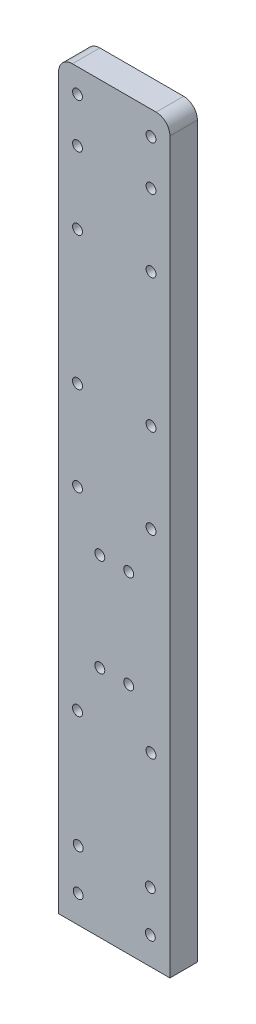
ISO-10303-21;
HEADER;
FILE_DESCRIPTION(('STEP AP214'),'2;1');
FILE_NAME('part.step','',(''),(''),'','','');
FILE_SCHEMA(('AUTOMOTIVE_DESIGN { 1 0 10303 214 1 1 1 1 }'));
ENDSEC;
DATA;
#1=APPLICATION_CONTEXT('core data for automotive mechanical design processes');
#2=APPLICATION_PROTOCOL_DEFINITION('international standard','automotive_design',2000,#1);
#3=PRODUCT_CONTEXT('',#1,'mechanical');
#4=PRODUCT('Part','Part','',(#3));
#5=PRODUCT_RELATED_PRODUCT_CATEGORY('part','',(#4));
#6=PRODUCT_DEFINITION_FORMATION('','',#4);
#7=PRODUCT_DEFINITION_CONTEXT('part definition',#1,'design');
#8=PRODUCT_DEFINITION('design','',#6,#7);
#9=PRODUCT_DEFINITION_SHAPE('','',#8);
#10=(LENGTH_UNIT() NAMED_UNIT(*) SI_UNIT(.MILLI.,.METRE.));
#11=(NAMED_UNIT(*) PLANE_ANGLE_UNIT() SI_UNIT($,.RADIAN.));
#12=(NAMED_UNIT(*) SI_UNIT($,.STERADIAN.) SOLID_ANGLE_UNIT());
#13=UNCERTAINTY_MEASURE_WITH_UNIT(LENGTH_MEASURE(1.E-05),#10,'distance_accuracy_value','');
#14=(GEOMETRIC_REPRESENTATION_CONTEXT(3) GLOBAL_UNCERTAINTY_ASSIGNED_CONTEXT((#13)) GLOBAL_UNIT_ASSIGNED_CONTEXT((#10,
#11,#12)) REPRESENTATION_CONTEXT('',''));
#15=CARTESIAN_POINT('',(0.,0.,0.));
#16=DIRECTION('',(0.,0.,1.));
#17=DIRECTION('',(1.,0.,0.));
#18=AXIS2_PLACEMENT_3D('',#15,#16,#17);
#19=CARTESIAN_POINT('',(0.,0.,4.));
#20=DIRECTION('',(0.,0.,1.));
#21=DIRECTION('',(1.,0.,0.));
#22=AXIS2_PLACEMENT_3D('',#19,#20,#21);
#23=PLANE('',#22);
#24=CARTESIAN_POINT('',(13.35,10.,4.));
#25=DIRECTION('',(0.,0.,1.));
#26=DIRECTION('',(-1.,0.,0.));
#27=AXIS2_PLACEMENT_3D('',#24,#25,#26);
#28=CIRCLE('',#27,0.72);
#29=CARTESIAN_POINT('',(12.63,10.,4.));
#30=VERTEX_POINT('',#29);
#31=EDGE_CURVE('E251',#30,#30,#28,.T.);
#32=ORIENTED_EDGE('',*,*,#31,.F.);
#33=EDGE_LOOP('',(#32));
#34=FACE_BOUND('',#33,.T.);
#35=CARTESIAN_POINT('',(2.85,10.,4.));
#36=DIRECTION('',(0.,0.,1.));
#37=DIRECTION('',(1.,0.,0.));
#38=AXIS2_PLACEMENT_3D('',#35,#36,#37);
#39=CIRCLE('',#38,0.72);
#40=CARTESIAN_POINT('',(3.57,10.,4.));
#41=VERTEX_POINT('',#40);
#42=EDGE_CURVE('E239',#41,#41,#39,.T.);
#43=ORIENTED_EDGE('',*,*,#42,.F.);
#44=EDGE_LOOP('',(#43));
#45=FACE_BOUND('',#44,.T.);
#46=CARTESIAN_POINT('',(2.74999999999998,68.21,4.));
#47=DIRECTION('',(0.,0.,1.));
#48=DIRECTION('',(1.,0.,0.));
#49=AXIS2_PLACEMENT_3D('',#46,#47,#48);
#50=CIRCLE('',#49,0.719999999999994);
#51=CARTESIAN_POINT('',(3.46999999999998,68.21,4.));
#52=VERTEX_POINT('',#51);
#53=EDGE_CURVE('E227',#52,#52,#50,.T.);
#54=ORIENTED_EDGE('',*,*,#53,.F.);
#55=EDGE_LOOP('',(#54));
#56=FACE_BOUND('',#55,.T.);
#57=CARTESIAN_POINT('',(2.74999999999999,55.21,4.));
#58=DIRECTION('',(0.,0.,1.));
#59=DIRECTION('',(1.,0.,0.));
#60=AXIS2_PLACEMENT_3D('',#57,#58,#59);
#61=CIRCLE('',#60,0.720000000000003);
#62=CARTESIAN_POINT('',(3.47,55.21,4.));
#63=VERTEX_POINT('',#62);
#64=EDGE_CURVE('E215',#63,#63,#61,.T.);
#65=ORIENTED_EDGE('',*,*,#64,.F.);
#66=EDGE_LOOP('',(#65));
#67=FACE_BOUND('',#66,.T.);
#68=CARTESIAN_POINT('',(13.45,104.66,4.));
#69=DIRECTION('',(0.,0.,1.));
#70=DIRECTION('',(-1.,0.,0.));
#71=AXIS2_PLACEMENT_3D('',#68,#69,#70);
#72=CIRCLE('',#71,0.71999999999999);
#73=CARTESIAN_POINT('',(12.73,104.66,4.));
#74=VERTEX_POINT('',#73);
#75=EDGE_CURVE('E203',#74,#74,#72,.T.);
#76=ORIENTED_EDGE('',*,*,#75,.F.);
#77=EDGE_LOOP('',(#76));
#78=FACE_BOUND('',#77,.T.);
#79=CARTESIAN_POINT('',(2.74999999999998,87.66,4.));
#80=DIRECTION('',(0.,0.,1.));
#81=DIRECTION('',(-1.,0.,0.));
#82=AXIS2_PLACEMENT_3D('',#79,#80,#81);
#83=CIRCLE('',#82,0.719999999999994);
#84=CARTESIAN_POINT('',(2.02999999999999,87.66,4.));
#85=VERTEX_POINT('',#84);
#86=EDGE_CURVE('E191',#85,#85,#83,.T.);
#87=ORIENTED_EDGE('',*,*,#86,.F.);
#88=EDGE_LOOP('',(#87));
#89=FACE_BOUND('',#88,.T.);
#90=CARTESIAN_POINT('',(2.75,27.,4.));
#91=DIRECTION('',(0.,0.,1.));
#92=DIRECTION('',(1.,0.,0.));
#93=AXIS2_PLACEMENT_3D('',#90,#91,#92);
#94=CIRCLE('',#93,0.72);
#95=CARTESIAN_POINT('',(3.47,27.,4.));
#96=VERTEX_POINT('',#95);
#97=EDGE_CURVE('E179',#96,#96,#94,.T.);
#98=ORIENTED_EDGE('',*,*,#97,.F.);
#99=EDGE_LOOP('',(#98));
#100=FACE_BOUND('',#99,.T.);
#101=CARTESIAN_POINT('',(6.,34.,4.));
#102=DIRECTION('',(0.,0.,1.));
#103=DIRECTION('',(1.,0.,0.));
#104=AXIS2_PLACEMENT_3D('',#101,#102,#103);
#105=CIRCLE('',#104,0.720000000000001);
#106=CARTESIAN_POINT('',(6.72,34.,4.));
#107=VERTEX_POINT('',#106);
#108=EDGE_CURVE('E167',#107,#107,#105,.T.);
#109=ORIENTED_EDGE('',*,*,#108,.F.);
#110=EDGE_LOOP('',(#109));
#111=FACE_BOUND('',#110,.T.);
#112=CARTESIAN_POINT('',(5.99999999999999,48.21,4.));
#113=DIRECTION('',(0.,0.,1.));
#114=DIRECTION('',(1.,0.,0.));
#115=AXIS2_PLACEMENT_3D('',#112,#113,#114);
#116=CIRCLE('',#115,0.720000000000002);
#117=CARTESIAN_POINT('',(6.72,48.21,4.));
#118=VERTEX_POINT('',#117);
#119=EDGE_CURVE('E155',#118,#118,#116,.T.);
#120=ORIENTED_EDGE('',*,*,#119,.F.);
#121=EDGE_LOOP('',(#120));
#122=FACE_BOUND('',#121,.T.);
#123=CARTESIAN_POINT('',(2.74999999999999,104.66,4.));
#124=DIRECTION('',(0.,0.,1.));
#125=DIRECTION('',(1.,0.,0.));
#126=AXIS2_PLACEMENT_3D('',#123,#124,#125);
#127=CIRCLE('',#126,0.719999999999994);
#128=CARTESIAN_POINT('',(3.46999999999998,104.66,4.));
#129=VERTEX_POINT('',#128);
#130=EDGE_CURVE('E143',#129,#129,#127,.T.);
#131=ORIENTED_EDGE('',*,*,#130,.F.);
#132=EDGE_LOOP('',(#131));
#133=FACE_BOUND('',#132,.T.);
#134=DIRECTION('',(0.,1.,0.));
#135=VECTOR('',#134,1.);
#136=CARTESIAN_POINT('',(16.2,0.,4.));
#137=LINE('',#136,#135);
#138=CARTESIAN_POINT('',(16.2,0.,4.));
#139=VERTEX_POINT('',#138);
#140=CARTESIAN_POINT('',(16.2,106.14,4.));
#141=VERTEX_POINT('',#140);
#142=EDGE_CURVE('E101',#139,#141,#137,.T.);
#143=ORIENTED_EDGE('',*,*,#142,.T.);
#144=CARTESIAN_POINT('',(14.2,106.14,4.));
#145=DIRECTION('',(0.,0.,1.));
#146=DIRECTION('',(1.,0.,0.));
#147=AXIS2_PLACEMENT_3D('',#144,#145,#146);
#148=CIRCLE('',#147,2.);
#149=CARTESIAN_POINT('',(14.2,108.14,4.));
#150=VERTEX_POINT('',#149);
#151=EDGE_CURVE('E40',#141,#150,#148,.T.);
#152=ORIENTED_EDGE('',*,*,#151,.T.);
#153=DIRECTION('',(-1.,0.,0.));
#154=VECTOR('',#153,1.);
#155=CARTESIAN_POINT('',(16.2,108.14,4.));
#156=LINE('',#155,#154);
#157=CARTESIAN_POINT('',(1.99999999999999,108.14,4.));
#158=VERTEX_POINT('',#157);
#159=EDGE_CURVE('E111',#150,#158,#156,.T.);
#160=ORIENTED_EDGE('',*,*,#159,.T.);
#161=CARTESIAN_POINT('',(1.99999999999999,106.14,4.));
#162=DIRECTION('',(0.,0.,1.));
#163=DIRECTION('',(1.,0.,0.));
#164=AXIS2_PLACEMENT_3D('',#161,#162,#163);
#165=CIRCLE('',#164,2.);
#166=CARTESIAN_POINT('',(0.,106.14,4.));
#167=VERTEX_POINT('',#166);
#168=EDGE_CURVE('E47',#158,#167,#165,.T.);
#169=ORIENTED_EDGE('',*,*,#168,.T.);
#170=DIRECTION('',(0.,-1.,0.));
#171=VECTOR('',#170,1.);
#172=CARTESIAN_POINT('',(0.,108.14,4.));
#173=LINE('',#172,#171);
#174=CARTESIAN_POINT('',(0.,0.,4.));
#175=VERTEX_POINT('',#174);
#176=EDGE_CURVE('E85',#167,#175,#173,.T.);
#177=ORIENTED_EDGE('',*,*,#176,.T.);
#178=DIRECTION('',(1.,0.,0.));
#179=VECTOR('',#178,1.);
#180=CARTESIAN_POINT('',(0.,0.,4.));
#181=LINE('',#180,#179);
#182=EDGE_CURVE('E88',#175,#139,#181,.T.);
#183=ORIENTED_EDGE('',*,*,#182,.T.);
#184=EDGE_LOOP('',(#143,#152,#160,#169,#177,#183));
#185=FACE_BOUND('',#184,.T.);
#186=CARTESIAN_POINT('',(10.2,48.21,4.));
#187=DIRECTION('',(0.,0.,1.));
#188=DIRECTION('',(1.,0.,0.));
#189=AXIS2_PLACEMENT_3D('',#186,#187,#188);
#190=CIRCLE('',#189,0.720000000000001);
#191=CARTESIAN_POINT('',(10.92,48.21,4.));
#192=VERTEX_POINT('',#191);
#193=EDGE_CURVE('E149',#192,#192,#190,.T.);
#194=ORIENTED_EDGE('',*,*,#193,.F.);
#195=EDGE_LOOP('',(#194));
#196=FACE_BOUND('',#195,.T.);
#197=CARTESIAN_POINT('',(10.2,34.,4.));
#198=DIRECTION('',(0.,0.,1.));
#199=DIRECTION('',(1.,0.,0.));
#200=AXIS2_PLACEMENT_3D('',#197,#198,#199);
#201=CIRCLE('',#200,0.720000000000001);
#202=CARTESIAN_POINT('',(10.92,34.,4.));
#203=VERTEX_POINT('',#202);
#204=EDGE_CURVE('E161',#203,#203,#201,.T.);
#205=ORIENTED_EDGE('',*,*,#204,.F.);
#206=EDGE_LOOP('',(#205));
#207=FACE_BOUND('',#206,.T.);
#208=CARTESIAN_POINT('',(13.45,27.,4.));
#209=DIRECTION('',(0.,0.,1.));
#210=DIRECTION('',(1.,0.,0.));
#211=AXIS2_PLACEMENT_3D('',#208,#209,#210);
#212=CIRCLE('',#211,0.72);
#213=CARTESIAN_POINT('',(14.17,27.,4.));
#214=VERTEX_POINT('',#213);
#215=EDGE_CURVE('E173',#214,#214,#212,.T.);
#216=ORIENTED_EDGE('',*,*,#215,.F.);
#217=EDGE_LOOP('',(#216));
#218=FACE_BOUND('',#217,.T.);
#219=CARTESIAN_POINT('',(13.45,55.21,4.));
#220=DIRECTION('',(0.,0.,1.));
#221=DIRECTION('',(1.,0.,0.));
#222=AXIS2_PLACEMENT_3D('',#219,#220,#221);
#223=CIRCLE('',#222,0.720000000000001);
#224=CARTESIAN_POINT('',(14.17,55.21,4.));
#225=VERTEX_POINT('',#224);
#226=EDGE_CURVE('E185',#225,#225,#223,.T.);
#227=ORIENTED_EDGE('',*,*,#226,.F.);
#228=EDGE_LOOP('',(#227));
#229=FACE_BOUND('',#228,.T.);
#230=CARTESIAN_POINT('',(13.45,87.66,4.));
#231=DIRECTION('',(0.,0.,1.));
#232=DIRECTION('',(-1.,0.,0.));
#233=AXIS2_PLACEMENT_3D('',#230,#231,#232);
#234=CIRCLE('',#233,0.71999999999999);
#235=CARTESIAN_POINT('',(12.73,87.66,4.));
#236=VERTEX_POINT('',#235);
#237=EDGE_CURVE('E197',#236,#236,#234,.T.);
#238=ORIENTED_EDGE('',*,*,#237,.F.);
#239=EDGE_LOOP('',(#238));
#240=FACE_BOUND('',#239,.T.);
#241=CARTESIAN_POINT('',(13.45,98.16,4.));
#242=DIRECTION('',(0.,0.,1.));
#243=DIRECTION('',(-1.,0.,0.));
#244=AXIS2_PLACEMENT_3D('',#241,#242,#243);
#245=CIRCLE('',#244,0.71999999999999);
#246=CARTESIAN_POINT('',(12.73,98.16,4.));
#247=VERTEX_POINT('',#246);
#248=EDGE_CURVE('E209',#247,#247,#245,.T.);
#249=ORIENTED_EDGE('',*,*,#248,.F.);
#250=EDGE_LOOP('',(#249));
#251=FACE_BOUND('',#250,.T.);
#252=CARTESIAN_POINT('',(13.45,68.21,4.));
#253=DIRECTION('',(0.,0.,1.));
#254=DIRECTION('',(1.,0.,0.));
#255=AXIS2_PLACEMENT_3D('',#252,#253,#254);
#256=CIRCLE('',#255,0.71999999999999);
#257=CARTESIAN_POINT('',(14.17,68.21,4.));
#258=VERTEX_POINT('',#257);
#259=EDGE_CURVE('E221',#258,#258,#256,.T.);
#260=ORIENTED_EDGE('',*,*,#259,.F.);
#261=EDGE_LOOP('',(#260));
#262=FACE_BOUND('',#261,.T.);
#263=CARTESIAN_POINT('',(2.74999999999999,98.16,4.));
#264=DIRECTION('',(0.,0.,1.));
#265=DIRECTION('',(1.,0.,0.));
#266=AXIS2_PLACEMENT_3D('',#263,#264,#265);
#267=CIRCLE('',#266,0.719999999999994);
#268=CARTESIAN_POINT('',(3.46999999999998,98.16,4.));
#269=VERTEX_POINT('',#268);
#270=EDGE_CURVE('E233',#269,#269,#267,.T.);
#271=ORIENTED_EDGE('',*,*,#270,.F.);
#272=EDGE_LOOP('',(#271));
#273=FACE_BOUND('',#272,.T.);
#274=CARTESIAN_POINT('',(2.85,4.,4.));
#275=DIRECTION('',(0.,0.,1.));
#276=DIRECTION('',(1.,0.,0.));
#277=AXIS2_PLACEMENT_3D('',#274,#275,#276);
#278=CIRCLE('',#277,0.72);
#279=CARTESIAN_POINT('',(3.57,4.,4.));
#280=VERTEX_POINT('',#279);
#281=EDGE_CURVE('E245',#280,#280,#278,.T.);
#282=ORIENTED_EDGE('',*,*,#281,.F.);
#283=EDGE_LOOP('',(#282));
#284=FACE_BOUND('',#283,.T.);
#285=CARTESIAN_POINT('',(13.35,4.,4.));
#286=DIRECTION('',(0.,0.,1.));
#287=DIRECTION('',(-1.,0.,0.));
#288=AXIS2_PLACEMENT_3D('',#285,#286,#287);
#289=CIRCLE('',#288,0.72);
#290=CARTESIAN_POINT('',(12.63,4.,4.));
#291=VERTEX_POINT('',#290);
#292=EDGE_CURVE('E257',#291,#291,#289,.T.);
#293=ORIENTED_EDGE('',*,*,#292,.F.);
#294=EDGE_LOOP('',(#293));
#295=FACE_BOUND('',#294,.T.);
#296=ADVANCED_FACE('F32',(#34,#45,#56,#67,#78,#89,#100,#111,#122,#133,#185,#196,#207,#218,#229,
#240,#251,#262,#273,#284,#295),#23,.T.);
#297=CARTESIAN_POINT('',(0.,0.,0.));
#298=DIRECTION('',(0.,0.,1.));
#299=DIRECTION('',(1.,0.,0.));
#300=AXIS2_PLACEMENT_3D('',#297,#298,#299);
#301=PLANE('',#300);
#302=DIRECTION('',(-1.,0.,0.));
#303=VECTOR('',#302,1.);
#304=CARTESIAN_POINT('',(16.2,108.14,0.));
#305=LINE('',#304,#303);
#306=CARTESIAN_POINT('',(14.2,108.14,0.));
#307=VERTEX_POINT('',#306);
#308=CARTESIAN_POINT('',(1.99999999999999,108.14,0.));
#309=VERTEX_POINT('',#308);
#310=EDGE_CURVE('E93',#307,#309,#305,.T.);
#311=ORIENTED_EDGE('',*,*,#310,.F.);
#312=CARTESIAN_POINT('',(14.2,106.14,0.));
#313=DIRECTION('',(0.,0.,1.));
#314=DIRECTION('',(1.,0.,0.));
#315=AXIS2_PLACEMENT_3D('',#312,#313,#314);
#316=CIRCLE('',#315,2.);
#317=CARTESIAN_POINT('',(16.2,106.14,0.));
#318=VERTEX_POINT('',#317);
#319=EDGE_CURVE('E119',#307,#318,#316,.F.);
#320=ORIENTED_EDGE('',*,*,#319,.T.);
#321=DIRECTION('',(0.,1.,0.));
#322=VECTOR('',#321,1.);
#323=CARTESIAN_POINT('',(16.2,0.,0.));
#324=LINE('',#323,#322);
#325=CARTESIAN_POINT('',(16.2,0.,0.));
#326=VERTEX_POINT('',#325);
#327=EDGE_CURVE('E137',#326,#318,#324,.T.);
#328=ORIENTED_EDGE('',*,*,#327,.F.);
#329=DIRECTION('',(1.,0.,0.));
#330=VECTOR('',#329,1.);
#331=CARTESIAN_POINT('',(0.,0.,0.));
#332=LINE('',#331,#330);
#333=CARTESIAN_POINT('',(0.,0.,0.));
#334=VERTEX_POINT('',#333);
#335=EDGE_CURVE('E139',#334,#326,#332,.T.);
#336=ORIENTED_EDGE('',*,*,#335,.F.);
#337=DIRECTION('',(0.,-1.,0.));
#338=VECTOR('',#337,1.);
#339=CARTESIAN_POINT('',(0.,108.14,0.));
#340=LINE('',#339,#338);
#341=CARTESIAN_POINT('',(0.,106.14,0.));
#342=VERTEX_POINT('',#341);
#343=EDGE_CURVE('E105',#342,#334,#340,.T.);
#344=ORIENTED_EDGE('',*,*,#343,.F.);
#345=CARTESIAN_POINT('',(1.99999999999999,106.14,0.));
#346=DIRECTION('',(0.,0.,1.));
#347=DIRECTION('',(1.,0.,0.));
#348=AXIS2_PLACEMENT_3D('',#345,#346,#347);
#349=CIRCLE('',#348,2.);
#350=EDGE_CURVE('E117',#342,#309,#349,.F.);
#351=ORIENTED_EDGE('',*,*,#350,.T.);
#352=EDGE_LOOP('',(#311,#320,#328,#336,#344,#351));
#353=FACE_BOUND('',#352,.T.);
#354=CARTESIAN_POINT('',(2.74999999999999,104.66,0.));
#355=DIRECTION('',(0.,0.,1.));
#356=DIRECTION('',(1.,0.,0.));
#357=AXIS2_PLACEMENT_3D('',#354,#355,#356);
#358=CIRCLE('',#357,0.719999999999994);
#359=CARTESIAN_POINT('',(3.46999999999998,104.66,0.));
#360=VERTEX_POINT('',#359);
#361=EDGE_CURVE('E146',#360,#360,#358,.T.);
#362=ORIENTED_EDGE('',*,*,#361,.T.);
#363=EDGE_LOOP('',(#362));
#364=FACE_BOUND('',#363,.T.);
#365=CARTESIAN_POINT('',(10.2,48.21,0.));
#366=DIRECTION('',(0.,0.,1.));
#367=DIRECTION('',(1.,0.,0.));
#368=AXIS2_PLACEMENT_3D('',#365,#366,#367);
#369=CIRCLE('',#368,0.720000000000001);
#370=CARTESIAN_POINT('',(10.92,48.21,0.));
#371=VERTEX_POINT('',#370);
#372=EDGE_CURVE('E152',#371,#371,#369,.T.);
#373=ORIENTED_EDGE('',*,*,#372,.T.);
#374=EDGE_LOOP('',(#373));
#375=FACE_BOUND('',#374,.T.);
#376=CARTESIAN_POINT('',(5.99999999999999,48.21,0.));
#377=DIRECTION('',(0.,0.,1.));
#378=DIRECTION('',(1.,0.,0.));
#379=AXIS2_PLACEMENT_3D('',#376,#377,#378);
#380=CIRCLE('',#379,0.720000000000002);
#381=CARTESIAN_POINT('',(6.72,48.21,0.));
#382=VERTEX_POINT('',#381);
#383=EDGE_CURVE('E158',#382,#382,#380,.T.);
#384=ORIENTED_EDGE('',*,*,#383,.T.);
#385=EDGE_LOOP('',(#384));
#386=FACE_BOUND('',#385,.T.);
#387=CARTESIAN_POINT('',(10.2,34.,0.));
#388=DIRECTION('',(0.,0.,1.));
#389=DIRECTION('',(1.,0.,0.));
#390=AXIS2_PLACEMENT_3D('',#387,#388,#389);
#391=CIRCLE('',#390,0.720000000000001);
#392=CARTESIAN_POINT('',(10.92,34.,0.));
#393=VERTEX_POINT('',#392);
#394=EDGE_CURVE('E164',#393,#393,#391,.T.);
#395=ORIENTED_EDGE('',*,*,#394,.T.);
#396=EDGE_LOOP('',(#395));
#397=FACE_BOUND('',#396,.T.);
#398=CARTESIAN_POINT('',(6.,34.,0.));
#399=DIRECTION('',(0.,0.,1.));
#400=DIRECTION('',(1.,0.,0.));
#401=AXIS2_PLACEMENT_3D('',#398,#399,#400);
#402=CIRCLE('',#401,0.720000000000001);
#403=CARTESIAN_POINT('',(6.72,34.,0.));
#404=VERTEX_POINT('',#403);
#405=EDGE_CURVE('E170',#404,#404,#402,.T.);
#406=ORIENTED_EDGE('',*,*,#405,.T.);
#407=EDGE_LOOP('',(#406));
#408=FACE_BOUND('',#407,.T.);
#409=CARTESIAN_POINT('',(13.45,27.,0.));
#410=DIRECTION('',(0.,0.,1.));
#411=DIRECTION('',(1.,0.,0.));
#412=AXIS2_PLACEMENT_3D('',#409,#410,#411);
#413=CIRCLE('',#412,0.72);
#414=CARTESIAN_POINT('',(14.17,27.,0.));
#415=VERTEX_POINT('',#414);
#416=EDGE_CURVE('E176',#415,#415,#413,.T.);
#417=ORIENTED_EDGE('',*,*,#416,.T.);
#418=EDGE_LOOP('',(#417));
#419=FACE_BOUND('',#418,.T.);
#420=CARTESIAN_POINT('',(2.75,27.,0.));
#421=DIRECTION('',(0.,0.,1.));
#422=DIRECTION('',(1.,0.,0.));
#423=AXIS2_PLACEMENT_3D('',#420,#421,#422);
#424=CIRCLE('',#423,0.72);
#425=CARTESIAN_POINT('',(3.47,27.,0.));
#426=VERTEX_POINT('',#425);
#427=EDGE_CURVE('E182',#426,#426,#424,.T.);
#428=ORIENTED_EDGE('',*,*,#427,.T.);
#429=EDGE_LOOP('',(#428));
#430=FACE_BOUND('',#429,.T.);
#431=CARTESIAN_POINT('',(13.45,55.21,0.));
#432=DIRECTION('',(0.,0.,1.));
#433=DIRECTION('',(1.,0.,0.));
#434=AXIS2_PLACEMENT_3D('',#431,#432,#433);
#435=CIRCLE('',#434,0.720000000000001);
#436=CARTESIAN_POINT('',(14.17,55.21,0.));
#437=VERTEX_POINT('',#436);
#438=EDGE_CURVE('E188',#437,#437,#435,.T.);
#439=ORIENTED_EDGE('',*,*,#438,.T.);
#440=EDGE_LOOP('',(#439));
#441=FACE_BOUND('',#440,.T.);
#442=CARTESIAN_POINT('',(2.74999999999998,87.66,0.));
#443=DIRECTION('',(0.,0.,1.));
#444=DIRECTION('',(-1.,0.,0.));
#445=AXIS2_PLACEMENT_3D('',#442,#443,#444);
#446=CIRCLE('',#445,0.719999999999994);
#447=CARTESIAN_POINT('',(2.02999999999999,87.66,0.));
#448=VERTEX_POINT('',#447);
#449=EDGE_CURVE('E194',#448,#448,#446,.T.);
#450=ORIENTED_EDGE('',*,*,#449,.T.);
#451=EDGE_LOOP('',(#450));
#452=FACE_BOUND('',#451,.T.);
#453=CARTESIAN_POINT('',(13.45,87.66,0.));
#454=DIRECTION('',(0.,0.,1.));
#455=DIRECTION('',(-1.,0.,0.));
#456=AXIS2_PLACEMENT_3D('',#453,#454,#455);
#457=CIRCLE('',#456,0.71999999999999);
#458=CARTESIAN_POINT('',(12.73,87.66,0.));
#459=VERTEX_POINT('',#458);
#460=EDGE_CURVE('E200',#459,#459,#457,.T.);
#461=ORIENTED_EDGE('',*,*,#460,.T.);
#462=EDGE_LOOP('',(#461));
#463=FACE_BOUND('',#462,.T.);
#464=CARTESIAN_POINT('',(13.45,104.66,0.));
#465=DIRECTION('',(0.,0.,1.));
#466=DIRECTION('',(-1.,0.,0.));
#467=AXIS2_PLACEMENT_3D('',#464,#465,#466);
#468=CIRCLE('',#467,0.71999999999999);
#469=CARTESIAN_POINT('',(12.73,104.66,0.));
#470=VERTEX_POINT('',#469);
#471=EDGE_CURVE('E206',#470,#470,#468,.T.);
#472=ORIENTED_EDGE('',*,*,#471,.T.);
#473=EDGE_LOOP('',(#472));
#474=FACE_BOUND('',#473,.T.);
#475=CARTESIAN_POINT('',(13.45,98.16,0.));
#476=DIRECTION('',(0.,0.,1.));
#477=DIRECTION('',(-1.,0.,0.));
#478=AXIS2_PLACEMENT_3D('',#475,#476,#477);
#479=CIRCLE('',#478,0.71999999999999);
#480=CARTESIAN_POINT('',(12.73,98.16,0.));
#481=VERTEX_POINT('',#480);
#482=EDGE_CURVE('E212',#481,#481,#479,.T.);
#483=ORIENTED_EDGE('',*,*,#482,.T.);
#484=EDGE_LOOP('',(#483));
#485=FACE_BOUND('',#484,.T.);
#486=CARTESIAN_POINT('',(2.74999999999999,55.21,0.));
#487=DIRECTION('',(0.,0.,1.));
#488=DIRECTION('',(1.,0.,0.));
#489=AXIS2_PLACEMENT_3D('',#486,#487,#488);
#490=CIRCLE('',#489,0.720000000000003);
#491=CARTESIAN_POINT('',(3.47,55.21,0.));
#492=VERTEX_POINT('',#491);
#493=EDGE_CURVE('E218',#492,#492,#490,.T.);
#494=ORIENTED_EDGE('',*,*,#493,.T.);
#495=EDGE_LOOP('',(#494));
#496=FACE_BOUND('',#495,.T.);
#497=CARTESIAN_POINT('',(13.45,68.21,0.));
#498=DIRECTION('',(0.,0.,1.));
#499=DIRECTION('',(1.,0.,0.));
#500=AXIS2_PLACEMENT_3D('',#497,#498,#499);
#501=CIRCLE('',#500,0.71999999999999);
#502=CARTESIAN_POINT('',(14.17,68.21,0.));
#503=VERTEX_POINT('',#502);
#504=EDGE_CURVE('E224',#503,#503,#501,.T.);
#505=ORIENTED_EDGE('',*,*,#504,.T.);
#506=EDGE_LOOP('',(#505));
#507=FACE_BOUND('',#506,.T.);
#508=CARTESIAN_POINT('',(2.74999999999998,68.21,0.));
#509=DIRECTION('',(0.,0.,1.));
#510=DIRECTION('',(1.,0.,0.));
#511=AXIS2_PLACEMENT_3D('',#508,#509,#510);
#512=CIRCLE('',#511,0.719999999999994);
#513=CARTESIAN_POINT('',(3.46999999999998,68.21,0.));
#514=VERTEX_POINT('',#513);
#515=EDGE_CURVE('E230',#514,#514,#512,.T.);
#516=ORIENTED_EDGE('',*,*,#515,.T.);
#517=EDGE_LOOP('',(#516));
#518=FACE_BOUND('',#517,.T.);
#519=CARTESIAN_POINT('',(2.74999999999999,98.16,0.));
#520=DIRECTION('',(0.,0.,1.));
#521=DIRECTION('',(1.,0.,0.));
#522=AXIS2_PLACEMENT_3D('',#519,#520,#521);
#523=CIRCLE('',#522,0.719999999999994);
#524=CARTESIAN_POINT('',(3.46999999999998,98.16,0.));
#525=VERTEX_POINT('',#524);
#526=EDGE_CURVE('E236',#525,#525,#523,.T.);
#527=ORIENTED_EDGE('',*,*,#526,.T.);
#528=EDGE_LOOP('',(#527));
#529=FACE_BOUND('',#528,.T.);
#530=CARTESIAN_POINT('',(2.85,10.,0.));
#531=DIRECTION('',(0.,0.,1.));
#532=DIRECTION('',(1.,0.,0.));
#533=AXIS2_PLACEMENT_3D('',#530,#531,#532);
#534=CIRCLE('',#533,0.72);
#535=CARTESIAN_POINT('',(3.57,10.,0.));
#536=VERTEX_POINT('',#535);
#537=EDGE_CURVE('E242',#536,#536,#534,.T.);
#538=ORIENTED_EDGE('',*,*,#537,.T.);
#539=EDGE_LOOP('',(#538));
#540=FACE_BOUND('',#539,.T.);
#541=CARTESIAN_POINT('',(2.85,4.,0.));
#542=DIRECTION('',(0.,0.,1.));
#543=DIRECTION('',(1.,0.,0.));
#544=AXIS2_PLACEMENT_3D('',#541,#542,#543);
#545=CIRCLE('',#544,0.72);
#546=CARTESIAN_POINT('',(3.57,4.,0.));
#547=VERTEX_POINT('',#546);
#548=EDGE_CURVE('E248',#547,#547,#545,.T.);
#549=ORIENTED_EDGE('',*,*,#548,.T.);
#550=EDGE_LOOP('',(#549));
#551=FACE_BOUND('',#550,.T.);
#552=CARTESIAN_POINT('',(13.35,10.,0.));
#553=DIRECTION('',(0.,0.,1.));
#554=DIRECTION('',(-1.,0.,0.));
#555=AXIS2_PLACEMENT_3D('',#552,#553,#554);
#556=CIRCLE('',#555,0.72);
#557=CARTESIAN_POINT('',(12.63,10.,0.));
#558=VERTEX_POINT('',#557);
#559=EDGE_CURVE('E254',#558,#558,#556,.T.);
#560=ORIENTED_EDGE('',*,*,#559,.T.);
#561=EDGE_LOOP('',(#560));
#562=FACE_BOUND('',#561,.T.);
#563=CARTESIAN_POINT('',(13.35,4.,0.));
#564=DIRECTION('',(0.,0.,1.));
#565=DIRECTION('',(-1.,0.,0.));
#566=AXIS2_PLACEMENT_3D('',#563,#564,#565);
#567=CIRCLE('',#566,0.72);
#568=CARTESIAN_POINT('',(12.63,4.,0.));
#569=VERTEX_POINT('',#568);
#570=EDGE_CURVE('E260',#569,#569,#567,.T.);
#571=ORIENTED_EDGE('',*,*,#570,.T.);
#572=EDGE_LOOP('',(#571));
#573=FACE_BOUND('',#572,.T.);
#574=ADVANCED_FACE('F135',(#353,#364,#375,#386,#397,#408,#419,#430,#441,#452,#463,#474,#485,
#496,#507,#518,#529,#540,#551,#562,#573),#301,.F.);
#575=CARTESIAN_POINT('',(0.,108.14,4.));
#576=DIRECTION('',(1.,0.,0.));
#577=DIRECTION('',(0.,1.,0.));
#578=AXIS2_PLACEMENT_3D('',#575,#576,#577);
#579=PLANE('',#578);
#580=ORIENTED_EDGE('',*,*,#176,.F.);
#581=DIRECTION('',(0.,0.,-1.));
#582=VECTOR('',#581,1.);
#583=CARTESIAN_POINT('',(0.,106.14,4.));
#584=LINE('',#583,#582);
#585=EDGE_CURVE('E11',#167,#342,#584,.T.);
#586=ORIENTED_EDGE('',*,*,#585,.T.);
#587=ORIENTED_EDGE('',*,*,#343,.T.);
#588=DIRECTION('',(0.,0.,-1.));
#589=VECTOR('',#588,1.);
#590=CARTESIAN_POINT('',(0.,0.,4.));
#591=LINE('',#590,#589);
#592=EDGE_CURVE('E98',#175,#334,#591,.T.);
#593=ORIENTED_EDGE('',*,*,#592,.F.);
#594=EDGE_LOOP('',(#580,#586,#587,#593));
#595=FACE_BOUND('',#594,.T.);
#596=ADVANCED_FACE('F103',(#595),#579,.F.);
#597=CARTESIAN_POINT('',(0.,0.,4.));
#598=DIRECTION('',(0.,1.,0.));
#599=DIRECTION('',(-1.,0.,0.));
#600=AXIS2_PLACEMENT_3D('',#597,#598,#599);
#601=PLANE('',#600);
#602=ORIENTED_EDGE('',*,*,#335,.T.);
#603=DIRECTION('',(0.,0.,-1.));
#604=VECTOR('',#603,1.);
#605=CARTESIAN_POINT('',(16.2,0.,4.));
#606=LINE('',#605,#604);
#607=EDGE_CURVE('E100',#139,#326,#606,.T.);
#608=ORIENTED_EDGE('',*,*,#607,.F.);
#609=ORIENTED_EDGE('',*,*,#182,.F.);
#610=ORIENTED_EDGE('',*,*,#592,.T.);
#611=EDGE_LOOP('',(#602,#608,#609,#610));
#612=FACE_BOUND('',#611,.T.);
#613=ADVANCED_FACE('F97',(#612),#601,.F.);
#614=CARTESIAN_POINT('',(16.2,0.,4.));
#615=DIRECTION('',(-1.,0.,0.));
#616=DIRECTION('',(0.,-1.,0.));
#617=AXIS2_PLACEMENT_3D('',#614,#615,#616);
#618=PLANE('',#617);
#619=ORIENTED_EDGE('',*,*,#327,.T.);
#620=DIRECTION('',(0.,0.,-1.));
#621=VECTOR('',#620,1.);
#622=CARTESIAN_POINT('',(16.2,106.14,4.));
#623=LINE('',#622,#621);
#624=EDGE_CURVE('E55',#318,#141,#623,.F.);
#625=ORIENTED_EDGE('',*,*,#624,.T.);
#626=ORIENTED_EDGE('',*,*,#142,.F.);
#627=ORIENTED_EDGE('',*,*,#607,.T.);
#628=EDGE_LOOP('',(#619,#625,#626,#627));
#629=FACE_BOUND('',#628,.T.);
#630=ADVANCED_FACE('F138',(#629),#618,.F.);
#631=CARTESIAN_POINT('',(16.2,108.14,4.));
#632=DIRECTION('',(0.,-1.,0.));
#633=DIRECTION('',(0.,0.,-1.));
#634=AXIS2_PLACEMENT_3D('',#631,#632,#633);
#635=PLANE('',#634);
#636=ORIENTED_EDGE('',*,*,#159,.F.);
#637=DIRECTION('',(0.,0.,-1.));
#638=VECTOR('',#637,1.);
#639=CARTESIAN_POINT('',(14.2,108.14,4.));
#640=LINE('',#639,#638);
#641=EDGE_CURVE('E109',#150,#307,#640,.T.);
#642=ORIENTED_EDGE('',*,*,#641,.T.);
#643=ORIENTED_EDGE('',*,*,#310,.T.);
#644=DIRECTION('',(0.,0.,-1.));
#645=VECTOR('',#644,1.);
#646=CARTESIAN_POINT('',(1.99999999999999,108.14,4.));
#647=LINE('',#646,#645);
#648=EDGE_CURVE('E107',#309,#158,#647,.F.);
#649=ORIENTED_EDGE('',*,*,#648,.T.);
#650=EDGE_LOOP('',(#636,#642,#643,#649));
#651=FACE_BOUND('',#650,.T.);
#652=ADVANCED_FACE('F127',(#651),#635,.F.);
#653=CARTESIAN_POINT('',(2.74999999999999,104.66,4.));
#654=DIRECTION('',(0.,0.,-1.));
#655=DIRECTION('',(-1.,0.,0.));
#656=AXIS2_PLACEMENT_3D('',#653,#654,#655);
#657=CYLINDRICAL_SURFACE('',#656,0.719999999999994);
#658=ORIENTED_EDGE('',*,*,#130,.T.);
#659=EDGE_LOOP('',(#658));
#660=FACE_BOUND('',#659,.T.);
#661=ORIENTED_EDGE('',*,*,#361,.F.);
#662=EDGE_LOOP('',(#661));
#663=FACE_BOUND('',#662,.T.);
#664=ADVANCED_FACE('F279',(#660,#663),#657,.F.);
#665=CARTESIAN_POINT('',(10.2,48.21,4.));
#666=DIRECTION('',(0.,0.,-1.));
#667=DIRECTION('',(-1.,0.,0.));
#668=AXIS2_PLACEMENT_3D('',#665,#666,#667);
#669=CYLINDRICAL_SURFACE('',#668,0.720000000000001);
#670=ORIENTED_EDGE('',*,*,#193,.T.);
#671=EDGE_LOOP('',(#670));
#672=FACE_BOUND('',#671,.T.);
#673=ORIENTED_EDGE('',*,*,#372,.F.);
#674=EDGE_LOOP('',(#673));
#675=FACE_BOUND('',#674,.T.);
#676=ADVANCED_FACE('F365',(#672,#675),#669,.F.);
#677=CARTESIAN_POINT('',(5.99999999999999,48.21,4.));
#678=DIRECTION('',(0.,0.,-1.));
#679=DIRECTION('',(-1.,0.,0.));
#680=AXIS2_PLACEMENT_3D('',#677,#678,#679);
#681=CYLINDRICAL_SURFACE('',#680,0.720000000000002);
#682=ORIENTED_EDGE('',*,*,#119,.T.);
#683=EDGE_LOOP('',(#682));
#684=FACE_BOUND('',#683,.T.);
#685=ORIENTED_EDGE('',*,*,#383,.F.);
#686=EDGE_LOOP('',(#685));
#687=FACE_BOUND('',#686,.T.);
#688=ADVANCED_FACE('F362',(#684,#687),#681,.F.);
#689=CARTESIAN_POINT('',(10.2,34.,4.));
#690=DIRECTION('',(0.,0.,-1.));
#691=DIRECTION('',(-1.,0.,0.));
#692=AXIS2_PLACEMENT_3D('',#689,#690,#691);
#693=CYLINDRICAL_SURFACE('',#692,0.720000000000001);
#694=ORIENTED_EDGE('',*,*,#204,.T.);
#695=EDGE_LOOP('',(#694));
#696=FACE_BOUND('',#695,.T.);
#697=ORIENTED_EDGE('',*,*,#394,.F.);
#698=EDGE_LOOP('',(#697));
#699=FACE_BOUND('',#698,.T.);
#700=ADVANCED_FACE('F358',(#696,#699),#693,.F.);
#701=CARTESIAN_POINT('',(6.,34.,4.));
#702=DIRECTION('',(0.,0.,-1.));
#703=DIRECTION('',(-1.,0.,0.));
#704=AXIS2_PLACEMENT_3D('',#701,#702,#703);
#705=CYLINDRICAL_SURFACE('',#704,0.720000000000001);
#706=ORIENTED_EDGE('',*,*,#108,.T.);
#707=EDGE_LOOP('',(#706));
#708=FACE_BOUND('',#707,.T.);
#709=ORIENTED_EDGE('',*,*,#405,.F.);
#710=EDGE_LOOP('',(#709));
#711=FACE_BOUND('',#710,.T.);
#712=ADVANCED_FACE('F354',(#708,#711),#705,.F.);
#713=CARTESIAN_POINT('',(13.45,27.,4.));
#714=DIRECTION('',(0.,0.,-1.));
#715=DIRECTION('',(-1.,0.,0.));
#716=AXIS2_PLACEMENT_3D('',#713,#714,#715);
#717=CYLINDRICAL_SURFACE('',#716,0.72);
#718=ORIENTED_EDGE('',*,*,#215,.T.);
#719=EDGE_LOOP('',(#718));
#720=FACE_BOUND('',#719,.T.);
#721=ORIENTED_EDGE('',*,*,#416,.F.);
#722=EDGE_LOOP('',(#721));
#723=FACE_BOUND('',#722,.T.);
#724=ADVANCED_FACE('F350',(#720,#723),#717,.F.);
#725=CARTESIAN_POINT('',(2.75,27.,4.));
#726=DIRECTION('',(0.,0.,-1.));
#727=DIRECTION('',(-1.,0.,0.));
#728=AXIS2_PLACEMENT_3D('',#725,#726,#727);
#729=CYLINDRICAL_SURFACE('',#728,0.72);
#730=ORIENTED_EDGE('',*,*,#97,.T.);
#731=EDGE_LOOP('',(#730));
#732=FACE_BOUND('',#731,.T.);
#733=ORIENTED_EDGE('',*,*,#427,.F.);
#734=EDGE_LOOP('',(#733));
#735=FACE_BOUND('',#734,.T.);
#736=ADVANCED_FACE('F346',(#732,#735),#729,.F.);
#737=CARTESIAN_POINT('',(13.45,55.21,4.));
#738=DIRECTION('',(0.,0.,-1.));
#739=DIRECTION('',(-1.,0.,0.));
#740=AXIS2_PLACEMENT_3D('',#737,#738,#739);
#741=CYLINDRICAL_SURFACE('',#740,0.720000000000001);
#742=ORIENTED_EDGE('',*,*,#226,.T.);
#743=EDGE_LOOP('',(#742));
#744=FACE_BOUND('',#743,.T.);
#745=ORIENTED_EDGE('',*,*,#438,.F.);
#746=EDGE_LOOP('',(#745));
#747=FACE_BOUND('',#746,.T.);
#748=ADVANCED_FACE('F342',(#744,#747),#741,.F.);
#749=CARTESIAN_POINT('',(2.74999999999998,87.66,4.));
#750=DIRECTION('',(0.,0.,-1.));
#751=DIRECTION('',(-1.,0.,0.));
#752=AXIS2_PLACEMENT_3D('',#749,#750,#751);
#753=CYLINDRICAL_SURFACE('',#752,0.719999999999994);
#754=ORIENTED_EDGE('',*,*,#86,.T.);
#755=EDGE_LOOP('',(#754));
#756=FACE_BOUND('',#755,.T.);
#757=ORIENTED_EDGE('',*,*,#449,.F.);
#758=EDGE_LOOP('',(#757));
#759=FACE_BOUND('',#758,.T.);
#760=ADVANCED_FACE('F338',(#756,#759),#753,.F.);
#761=CARTESIAN_POINT('',(13.45,87.66,4.));
#762=DIRECTION('',(0.,0.,-1.));
#763=DIRECTION('',(-1.,0.,0.));
#764=AXIS2_PLACEMENT_3D('',#761,#762,#763);
#765=CYLINDRICAL_SURFACE('',#764,0.71999999999999);
#766=ORIENTED_EDGE('',*,*,#237,.T.);
#767=EDGE_LOOP('',(#766));
#768=FACE_BOUND('',#767,.T.);
#769=ORIENTED_EDGE('',*,*,#460,.F.);
#770=EDGE_LOOP('',(#769));
#771=FACE_BOUND('',#770,.T.);
#772=ADVANCED_FACE('F334',(#768,#771),#765,.F.);
#773=CARTESIAN_POINT('',(13.45,104.66,4.));
#774=DIRECTION('',(0.,0.,-1.));
#775=DIRECTION('',(-1.,0.,0.));
#776=AXIS2_PLACEMENT_3D('',#773,#774,#775);
#777=CYLINDRICAL_SURFACE('',#776,0.71999999999999);
#778=ORIENTED_EDGE('',*,*,#75,.T.);
#779=EDGE_LOOP('',(#778));
#780=FACE_BOUND('',#779,.T.);
#781=ORIENTED_EDGE('',*,*,#471,.F.);
#782=EDGE_LOOP('',(#781));
#783=FACE_BOUND('',#782,.T.);
#784=ADVANCED_FACE('F330',(#780,#783),#777,.F.);
#785=CARTESIAN_POINT('',(13.45,98.16,4.));
#786=DIRECTION('',(0.,0.,-1.));
#787=DIRECTION('',(-1.,0.,0.));
#788=AXIS2_PLACEMENT_3D('',#785,#786,#787);
#789=CYLINDRICAL_SURFACE('',#788,0.71999999999999);
#790=ORIENTED_EDGE('',*,*,#248,.T.);
#791=EDGE_LOOP('',(#790));
#792=FACE_BOUND('',#791,.T.);
#793=ORIENTED_EDGE('',*,*,#482,.F.);
#794=EDGE_LOOP('',(#793));
#795=FACE_BOUND('',#794,.T.);
#796=ADVANCED_FACE('F326',(#792,#795),#789,.F.);
#797=CARTESIAN_POINT('',(2.74999999999999,55.21,4.));
#798=DIRECTION('',(0.,0.,-1.));
#799=DIRECTION('',(-1.,0.,0.));
#800=AXIS2_PLACEMENT_3D('',#797,#798,#799);
#801=CYLINDRICAL_SURFACE('',#800,0.720000000000003);
#802=ORIENTED_EDGE('',*,*,#64,.T.);
#803=EDGE_LOOP('',(#802));
#804=FACE_BOUND('',#803,.T.);
#805=ORIENTED_EDGE('',*,*,#493,.F.);
#806=EDGE_LOOP('',(#805));
#807=FACE_BOUND('',#806,.T.);
#808=ADVANCED_FACE('F322',(#804,#807),#801,.F.);
#809=CARTESIAN_POINT('',(13.45,68.21,4.));
#810=DIRECTION('',(0.,0.,-1.));
#811=DIRECTION('',(-1.,0.,0.));
#812=AXIS2_PLACEMENT_3D('',#809,#810,#811);
#813=CYLINDRICAL_SURFACE('',#812,0.71999999999999);
#814=ORIENTED_EDGE('',*,*,#259,.T.);
#815=EDGE_LOOP('',(#814));
#816=FACE_BOUND('',#815,.T.);
#817=ORIENTED_EDGE('',*,*,#504,.F.);
#818=EDGE_LOOP('',(#817));
#819=FACE_BOUND('',#818,.T.);
#820=ADVANCED_FACE('F318',(#816,#819),#813,.F.);
#821=CARTESIAN_POINT('',(2.74999999999998,68.21,4.));
#822=DIRECTION('',(0.,0.,-1.));
#823=DIRECTION('',(-1.,0.,0.));
#824=AXIS2_PLACEMENT_3D('',#821,#822,#823);
#825=CYLINDRICAL_SURFACE('',#824,0.719999999999994);
#826=ORIENTED_EDGE('',*,*,#53,.T.);
#827=EDGE_LOOP('',(#826));
#828=FACE_BOUND('',#827,.T.);
#829=ORIENTED_EDGE('',*,*,#515,.F.);
#830=EDGE_LOOP('',(#829));
#831=FACE_BOUND('',#830,.T.);
#832=ADVANCED_FACE('F314',(#828,#831),#825,.F.);
#833=CARTESIAN_POINT('',(2.74999999999999,98.16,4.));
#834=DIRECTION('',(0.,0.,-1.));
#835=DIRECTION('',(-1.,0.,0.));
#836=AXIS2_PLACEMENT_3D('',#833,#834,#835);
#837=CYLINDRICAL_SURFACE('',#836,0.719999999999994);
#838=ORIENTED_EDGE('',*,*,#270,.T.);
#839=EDGE_LOOP('',(#838));
#840=FACE_BOUND('',#839,.T.);
#841=ORIENTED_EDGE('',*,*,#526,.F.);
#842=EDGE_LOOP('',(#841));
#843=FACE_BOUND('',#842,.T.);
#844=ADVANCED_FACE('F310',(#840,#843),#837,.F.);
#845=CARTESIAN_POINT('',(2.85,10.,4.));
#846=DIRECTION('',(0.,0.,-1.));
#847=DIRECTION('',(-1.,0.,0.));
#848=AXIS2_PLACEMENT_3D('',#845,#846,#847);
#849=CYLINDRICAL_SURFACE('',#848,0.72);
#850=ORIENTED_EDGE('',*,*,#42,.T.);
#851=EDGE_LOOP('',(#850));
#852=FACE_BOUND('',#851,.T.);
#853=ORIENTED_EDGE('',*,*,#537,.F.);
#854=EDGE_LOOP('',(#853));
#855=FACE_BOUND('',#854,.T.);
#856=ADVANCED_FACE('F306',(#852,#855),#849,.F.);
#857=CARTESIAN_POINT('',(2.85,4.,4.));
#858=DIRECTION('',(0.,0.,-1.));
#859=DIRECTION('',(-1.,0.,0.));
#860=AXIS2_PLACEMENT_3D('',#857,#858,#859);
#861=CYLINDRICAL_SURFACE('',#860,0.72);
#862=ORIENTED_EDGE('',*,*,#281,.T.);
#863=EDGE_LOOP('',(#862));
#864=FACE_BOUND('',#863,.T.);
#865=ORIENTED_EDGE('',*,*,#548,.F.);
#866=EDGE_LOOP('',(#865));
#867=FACE_BOUND('',#866,.T.);
#868=ADVANCED_FACE('F300',(#864,#867),#861,.F.);
#869=CARTESIAN_POINT('',(13.35,10.,4.));
#870=DIRECTION('',(0.,0.,-1.));
#871=DIRECTION('',(-1.,0.,0.));
#872=AXIS2_PLACEMENT_3D('',#869,#870,#871);
#873=CYLINDRICAL_SURFACE('',#872,0.72);
#874=ORIENTED_EDGE('',*,*,#31,.T.);
#875=EDGE_LOOP('',(#874));
#876=FACE_BOUND('',#875,.T.);
#877=ORIENTED_EDGE('',*,*,#559,.F.);
#878=EDGE_LOOP('',(#877));
#879=FACE_BOUND('',#878,.T.);
#880=ADVANCED_FACE('F295',(#876,#879),#873,.F.);
#881=CARTESIAN_POINT('',(13.35,4.,4.));
#882=DIRECTION('',(0.,0.,-1.));
#883=DIRECTION('',(-1.,0.,0.));
#884=AXIS2_PLACEMENT_3D('',#881,#882,#883);
#885=CYLINDRICAL_SURFACE('',#884,0.72);
#886=ORIENTED_EDGE('',*,*,#292,.T.);
#887=EDGE_LOOP('',(#886));
#888=FACE_BOUND('',#887,.T.);
#889=ORIENTED_EDGE('',*,*,#570,.F.);
#890=EDGE_LOOP('',(#889));
#891=FACE_BOUND('',#890,.T.);
#892=ADVANCED_FACE('F266',(#888,#891),#885,.F.);
#893=CARTESIAN_POINT('',(14.2,106.14,4.));
#894=DIRECTION('',(0.,0.,-1.));
#895=DIRECTION('',(-1.,0.,0.));
#896=AXIS2_PLACEMENT_3D('',#893,#894,#895);
#897=CYLINDRICAL_SURFACE('',#896,2.);
#898=ORIENTED_EDGE('',*,*,#151,.F.);
#899=ORIENTED_EDGE('',*,*,#624,.F.);
#900=ORIENTED_EDGE('',*,*,#319,.F.);
#901=ORIENTED_EDGE('',*,*,#641,.F.);
#902=EDGE_LOOP('',(#898,#899,#900,#901));
#903=FACE_BOUND('',#902,.T.);
#904=ADVANCED_FACE('F132',(#903),#897,.T.);
#905=CARTESIAN_POINT('',(1.99999999999999,106.14,4.));
#906=DIRECTION('',(0.,0.,-1.));
#907=DIRECTION('',(-1.,0.,0.));
#908=AXIS2_PLACEMENT_3D('',#905,#906,#907);
#909=CYLINDRICAL_SURFACE('',#908,2.);
#910=ORIENTED_EDGE('',*,*,#168,.F.);
#911=ORIENTED_EDGE('',*,*,#648,.F.);
#912=ORIENTED_EDGE('',*,*,#350,.F.);
#913=ORIENTED_EDGE('',*,*,#585,.F.);
#914=EDGE_LOOP('',(#910,#911,#912,#913));
#915=FACE_BOUND('',#914,.T.);
#916=ADVANCED_FACE('F34',(#915),#909,.T.);
#917=CLOSED_SHELL('',(#296,#574,#596,#613,#630,#652,#664,#676,#688,#700,#712,#724,#736,#748,
#760,#772,#784,#796,#808,#820,#832,#844,#856,#868,#880,#892,#904,#916));
#918=MANIFOLD_SOLID_BREP('B2',#917);
#919=ADVANCED_BREP_SHAPE_REPRESENTATION('',(#18,#918),#14);
#920=SHAPE_DEFINITION_REPRESENTATION(#9,#919);
ENDSEC;
END-ISO-10303-21;
